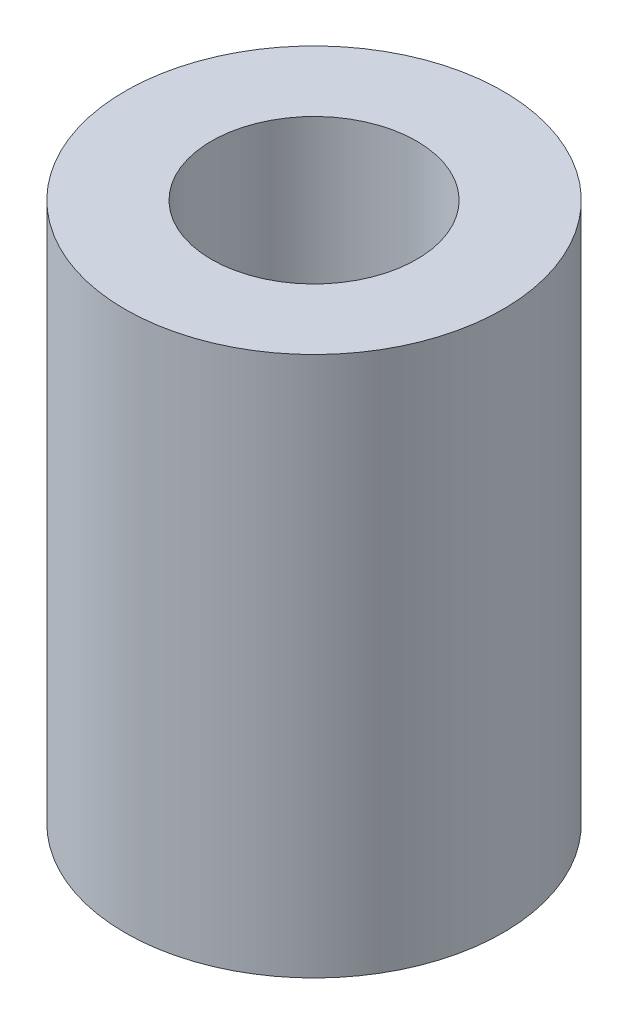
ISO-10303-21;
HEADER;
FILE_DESCRIPTION(('STEP AP214'),'2;1');
FILE_NAME('part.step','',(''),(''),'','','');
FILE_SCHEMA(('AUTOMOTIVE_DESIGN { 1 0 10303 214 1 1 1 1 }'));
ENDSEC;
DATA;
#1=APPLICATION_CONTEXT('core data for automotive mechanical design processes');
#2=APPLICATION_PROTOCOL_DEFINITION('international standard','automotive_design',2000,#1);
#3=PRODUCT_CONTEXT('',#1,'mechanical');
#4=PRODUCT('Part','Part','',(#3));
#5=PRODUCT_RELATED_PRODUCT_CATEGORY('part','',(#4));
#6=PRODUCT_DEFINITION_FORMATION('','',#4);
#7=PRODUCT_DEFINITION_CONTEXT('part definition',#1,'design');
#8=PRODUCT_DEFINITION('design','',#6,#7);
#9=PRODUCT_DEFINITION_SHAPE('','',#8);
#10=(LENGTH_UNIT() NAMED_UNIT(*) SI_UNIT(.MILLI.,.METRE.));
#11=(NAMED_UNIT(*) PLANE_ANGLE_UNIT() SI_UNIT($,.RADIAN.));
#12=(NAMED_UNIT(*) SI_UNIT($,.STERADIAN.) SOLID_ANGLE_UNIT());
#13=UNCERTAINTY_MEASURE_WITH_UNIT(LENGTH_MEASURE(1.E-05),#10,'distance_accuracy_value','');
#14=(GEOMETRIC_REPRESENTATION_CONTEXT(3) GLOBAL_UNCERTAINTY_ASSIGNED_CONTEXT((#13)) GLOBAL_UNIT_ASSIGNED_CONTEXT((#10,
#11,#12)) REPRESENTATION_CONTEXT('',''));
#15=CARTESIAN_POINT('',(0.,0.,0.));
#16=DIRECTION('',(0.,0.,1.));
#17=DIRECTION('',(1.,0.,0.));
#18=AXIS2_PLACEMENT_3D('',#15,#16,#17);
#19=CARTESIAN_POINT('',(0.,5.,0.));
#20=DIRECTION('',(0.,1.,0.));
#21=DIRECTION('',(0.,0.,1.));
#22=AXIS2_PLACEMENT_3D('',#19,#20,#21);
#23=PLANE('',#22);
#24=CARTESIAN_POINT('',(0.,5.,0.));
#25=DIRECTION('',(0.,1.,0.));
#26=DIRECTION('',(0.,0.,1.));
#27=AXIS2_PLACEMENT_3D('',#24,#25,#26);
#28=CIRCLE('',#27,1.75);
#29=CARTESIAN_POINT('',(0.,5.,1.75));
#30=VERTEX_POINT('',#29);
#31=EDGE_CURVE('E10',#30,#30,#28,.T.);
#32=ORIENTED_EDGE('',*,*,#31,.T.);
#33=EDGE_LOOP('',(#32));
#34=FACE_BOUND('',#33,.T.);
#35=CARTESIAN_POINT('',(0.,5.,0.));
#36=DIRECTION('',(0.,1.,0.));
#37=DIRECTION('',(0.,0.,1.));
#38=AXIS2_PLACEMENT_3D('',#35,#36,#37);
#39=CIRCLE('',#38,0.95);
#40=CARTESIAN_POINT('',(0.,5.,0.95));
#41=VERTEX_POINT('',#40);
#42=EDGE_CURVE('E50',#41,#41,#39,.T.);
#43=ORIENTED_EDGE('',*,*,#42,.F.);
#44=EDGE_LOOP('',(#43));
#45=FACE_BOUND('',#44,.T.);
#46=ADVANCED_FACE('F37',(#34,#45),#23,.T.);
#47=CARTESIAN_POINT('',(0.,0.,0.));
#48=DIRECTION('',(0.,1.,0.));
#49=DIRECTION('',(0.,0.,1.));
#50=AXIS2_PLACEMENT_3D('',#47,#48,#49);
#51=PLANE('',#50);
#52=CARTESIAN_POINT('',(0.,0.,0.));
#53=DIRECTION('',(0.,1.,0.));
#54=DIRECTION('',(0.,0.,1.));
#55=AXIS2_PLACEMENT_3D('',#52,#53,#54);
#56=CIRCLE('',#55,1.75);
#57=CARTESIAN_POINT('',(0.,0.,1.75));
#58=VERTEX_POINT('',#57);
#59=EDGE_CURVE('E41',#58,#58,#56,.T.);
#60=ORIENTED_EDGE('',*,*,#59,.F.);
#61=EDGE_LOOP('',(#60));
#62=FACE_BOUND('',#61,.T.);
#63=CARTESIAN_POINT('',(0.,0.,0.));
#64=DIRECTION('',(0.,1.,0.));
#65=DIRECTION('',(0.,0.,1.));
#66=AXIS2_PLACEMENT_3D('',#63,#64,#65);
#67=CIRCLE('',#66,0.95);
#68=CARTESIAN_POINT('',(0.,0.,0.95));
#69=VERTEX_POINT('',#68);
#70=EDGE_CURVE('E52',#69,#69,#67,.T.);
#71=ORIENTED_EDGE('',*,*,#70,.T.);
#72=EDGE_LOOP('',(#71));
#73=FACE_BOUND('',#72,.T.);
#74=ADVANCED_FACE('F64',(#62,#73),#51,.F.);
#75=CARTESIAN_POINT('',(0.,5.,0.));
#76=DIRECTION('',(0.,-1.,0.));
#77=DIRECTION('',(0.,0.,-1.));
#78=AXIS2_PLACEMENT_3D('',#75,#76,#77);
#79=CYLINDRICAL_SURFACE('',#78,1.75);
#80=ORIENTED_EDGE('',*,*,#31,.F.);
#81=EDGE_LOOP('',(#80));
#82=FACE_BOUND('',#81,.T.);
#83=ORIENTED_EDGE('',*,*,#59,.T.);
#84=EDGE_LOOP('',(#83));
#85=FACE_BOUND('',#84,.T.);
#86=ADVANCED_FACE('F39',(#82,#85),#79,.T.);
#87=CARTESIAN_POINT('',(0.,5.,0.));
#88=DIRECTION('',(0.,-1.,0.));
#89=DIRECTION('',(0.,0.,-1.));
#90=AXIS2_PLACEMENT_3D('',#87,#88,#89);
#91=CYLINDRICAL_SURFACE('',#90,0.95);
#92=ORIENTED_EDGE('',*,*,#42,.T.);
#93=EDGE_LOOP('',(#92));
#94=FACE_BOUND('',#93,.T.);
#95=ORIENTED_EDGE('',*,*,#70,.F.);
#96=EDGE_LOOP('',(#95));
#97=FACE_BOUND('',#96,.T.);
#98=ADVANCED_FACE('F60',(#94,#97),#91,.F.);
#99=CLOSED_SHELL('',(#46,#74,#86,#98));
#100=MANIFOLD_SOLID_BREP('B2',#99);
#101=ADVANCED_BREP_SHAPE_REPRESENTATION('',(#18,#100),#14);
#102=SHAPE_DEFINITION_REPRESENTATION(#9,#101);
ENDSEC;
END-ISO-10303-21;
